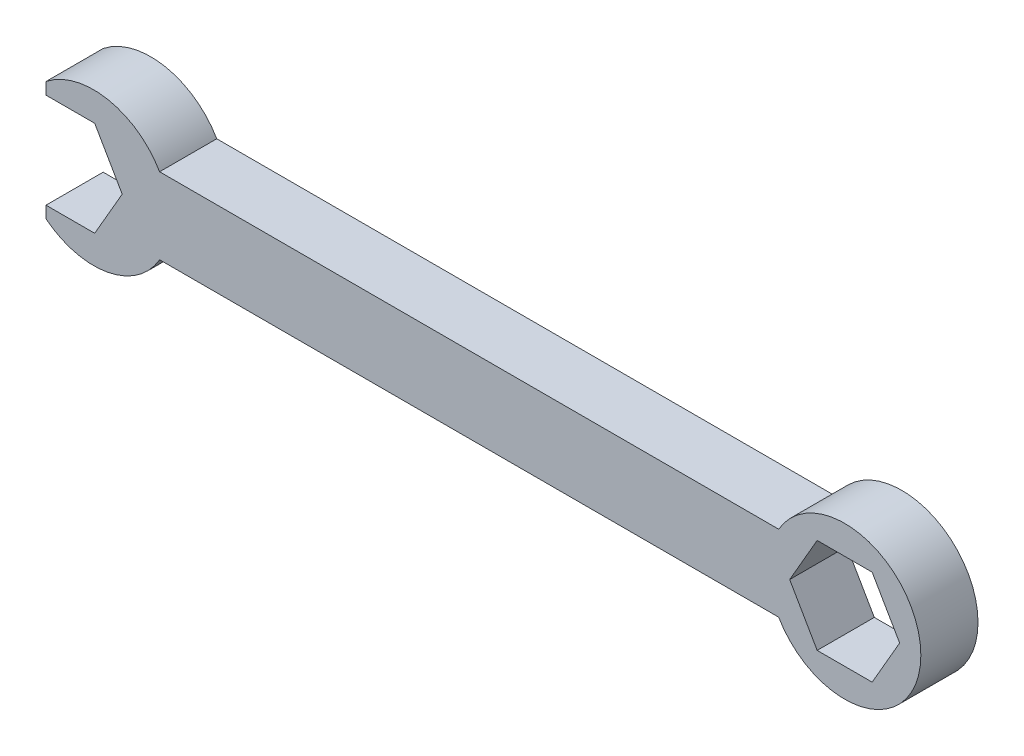
ISO-10303-21;
HEADER;
FILE_DESCRIPTION(('STEP AP214'),'2;1');
FILE_NAME('part.step','',(''),(''),'','','');
FILE_SCHEMA(('AUTOMOTIVE_DESIGN { 1 0 10303 214 1 1 1 1 }'));
ENDSEC;
DATA;
#1=APPLICATION_CONTEXT('core data for automotive mechanical design processes');
#2=APPLICATION_PROTOCOL_DEFINITION('international standard','automotive_design',2000,#1);
#3=PRODUCT_CONTEXT('',#1,'mechanical');
#4=PRODUCT('Part','Part','',(#3));
#5=PRODUCT_RELATED_PRODUCT_CATEGORY('part','',(#4));
#6=PRODUCT_DEFINITION_FORMATION('','',#4);
#7=PRODUCT_DEFINITION_CONTEXT('part definition',#1,'design');
#8=PRODUCT_DEFINITION('design','',#6,#7);
#9=PRODUCT_DEFINITION_SHAPE('','',#8);
#10=(LENGTH_UNIT() NAMED_UNIT(*) SI_UNIT(.MILLI.,.METRE.));
#11=(NAMED_UNIT(*) PLANE_ANGLE_UNIT() SI_UNIT($,.RADIAN.));
#12=(NAMED_UNIT(*) SI_UNIT($,.STERADIAN.) SOLID_ANGLE_UNIT());
#13=UNCERTAINTY_MEASURE_WITH_UNIT(LENGTH_MEASURE(1.E-05),#10,'distance_accuracy_value','');
#14=(GEOMETRIC_REPRESENTATION_CONTEXT(3) GLOBAL_UNCERTAINTY_ASSIGNED_CONTEXT((#13)) GLOBAL_UNIT_ASSIGNED_CONTEXT((#10,
#11,#12)) REPRESENTATION_CONTEXT('',''));
#15=CARTESIAN_POINT('',(0.,0.,0.));
#16=DIRECTION('',(0.,0.,1.));
#17=DIRECTION('',(1.,0.,0.));
#18=AXIS2_PLACEMENT_3D('',#15,#16,#17);
#19=CARTESIAN_POINT('',(5.49926131403122,-3.17499999999998,7.62));
#20=DIRECTION('',(-0.866025403784441,0.499999999999995,0.));
#21=DIRECTION('',(-0.499999999999995,-0.866025403784441,0.));
#22=AXIS2_PLACEMENT_3D('',#19,#20,#21);
#23=PLANE('',#22);
#24=DIRECTION('',(0.499999999999995,0.866025403784441,0.));
#25=VECTOR('',#24,1.);
#26=CARTESIAN_POINT('',(5.49926131403122,-3.17499999999998,0.));
#27=LINE('',#26,#25);
#28=CARTESIAN_POINT('',(3.6661742093542,-6.34999999999996,0.));
#29=VERTEX_POINT('',#28);
#30=CARTESIAN_POINT('',(7.33234841870825,0.,0.));
#31=VERTEX_POINT('',#30);
#32=EDGE_CURVE('E239',#29,#31,#27,.T.);
#33=ORIENTED_EDGE('',*,*,#32,.F.);
#34=DIRECTION('',(0.,0.,-1.));
#35=VECTOR('',#34,1.);
#36=CARTESIAN_POINT('',(3.6661742093542,-6.34999999999996,7.62));
#37=LINE('',#36,#35);
#38=CARTESIAN_POINT('',(3.6661742093542,-6.34999999999996,7.62));
#39=VERTEX_POINT('',#38);
#40=EDGE_CURVE('E11',#39,#29,#37,.T.);
#41=ORIENTED_EDGE('',*,*,#40,.F.);
#42=DIRECTION('',(0.499999999999995,0.866025403784441,0.));
#43=VECTOR('',#42,1.);
#44=CARTESIAN_POINT('',(5.49926131403122,-3.17499999999998,7.62));
#45=LINE('',#44,#43);
#46=CARTESIAN_POINT('',(7.33234841870825,0.,7.62));
#47=VERTEX_POINT('',#46);
#48=EDGE_CURVE('E357',#39,#47,#45,.T.);
#49=ORIENTED_EDGE('',*,*,#48,.T.);
#50=DIRECTION('',(0.,0.,-1.));
#51=VECTOR('',#50,1.);
#52=CARTESIAN_POINT('',(7.33234841870825,0.,7.62));
#53=LINE('',#52,#51);
#54=EDGE_CURVE('E61',#47,#31,#53,.T.);
#55=ORIENTED_EDGE('',*,*,#54,.T.);
#56=EDGE_LOOP('',(#33,#41,#49,#55));
#57=FACE_BOUND('',#56,.T.);
#58=ADVANCED_FACE('F41',(#57),#23,.T.);
#59=CARTESIAN_POINT('',(0.,-6.35,7.62));
#60=DIRECTION('',(0.,1.,0.));
#61=DIRECTION('',(-1.,0.,0.));
#62=AXIS2_PLACEMENT_3D('',#59,#60,#61);
#63=PLANE('',#62);
#64=DIRECTION('',(1.,0.,0.));
#65=VECTOR('',#64,1.);
#66=CARTESIAN_POINT('',(0.,-6.35,0.));
#67=LINE('',#66,#65);
#68=CARTESIAN_POINT('',(-3.66617420935407,-6.35000000000004,0.));
#69=VERTEX_POINT('',#68);
#70=EDGE_CURVE('E242',#69,#29,#67,.T.);
#71=ORIENTED_EDGE('',*,*,#70,.F.);
#72=DIRECTION('',(0.,0.,-1.));
#73=VECTOR('',#72,1.);
#74=CARTESIAN_POINT('',(-3.66617420935407,-6.35000000000004,7.62));
#75=LINE('',#74,#73);
#76=CARTESIAN_POINT('',(-3.66617420935407,-6.35000000000004,7.62));
#77=VERTEX_POINT('',#76);
#78=EDGE_CURVE('E52',#77,#69,#75,.T.);
#79=ORIENTED_EDGE('',*,*,#78,.F.);
#80=DIRECTION('',(1.,0.,0.));
#81=VECTOR('',#80,1.);
#82=CARTESIAN_POINT('',(0.,-6.35,7.62));
#83=LINE('',#82,#81);
#84=EDGE_CURVE('E360',#77,#39,#83,.T.);
#85=ORIENTED_EDGE('',*,*,#84,.T.);
#86=ORIENTED_EDGE('',*,*,#40,.T.);
#87=EDGE_LOOP('',(#71,#79,#85,#86));
#88=FACE_BOUND('',#87,.T.);
#89=ADVANCED_FACE('F383',(#88),#63,.T.);
#90=CARTESIAN_POINT('',(-5.49926131403116,-3.17500000000004,7.62));
#91=DIRECTION('',(0.866025403784435,0.500000000000007,0.));
#92=DIRECTION('',(-0.500000000000007,0.866025403784435,0.));
#93=AXIS2_PLACEMENT_3D('',#90,#91,#92);
#94=PLANE('',#93);
#95=DIRECTION('',(0.500000000000007,-0.866025403784435,0.));
#96=VECTOR('',#95,1.);
#97=CARTESIAN_POINT('',(-5.49926131403116,-3.17500000000004,0.));
#98=LINE('',#97,#96);
#99=CARTESIAN_POINT('',(-7.33234841870825,0.,0.));
#100=VERTEX_POINT('',#99);
#101=EDGE_CURVE('E246',#100,#69,#98,.T.);
#102=ORIENTED_EDGE('',*,*,#101,.F.);
#103=DIRECTION('',(0.,0.,-1.));
#104=VECTOR('',#103,1.);
#105=CARTESIAN_POINT('',(-7.33234841870825,0.,7.62));
#106=LINE('',#105,#104);
#107=CARTESIAN_POINT('',(-7.33234841870825,0.,7.62));
#108=VERTEX_POINT('',#107);
#109=EDGE_CURVE('E178',#108,#100,#106,.T.);
#110=ORIENTED_EDGE('',*,*,#109,.F.);
#111=DIRECTION('',(0.500000000000007,-0.866025403784435,0.));
#112=VECTOR('',#111,1.);
#113=CARTESIAN_POINT('',(-5.49926131403116,-3.17500000000004,7.62));
#114=LINE('',#113,#112);
#115=EDGE_CURVE('E189',#108,#77,#114,.T.);
#116=ORIENTED_EDGE('',*,*,#115,.T.);
#117=ORIENTED_EDGE('',*,*,#78,.T.);
#118=EDGE_LOOP('',(#102,#110,#116,#117));
#119=FACE_BOUND('',#118,.T.);
#120=ADVANCED_FACE('F366',(#119),#94,.T.);
#121=CARTESIAN_POINT('',(-5.4992613140312,3.17499999999997,7.62));
#122=DIRECTION('',(0.866025403784441,-0.499999999999995,0.));
#123=DIRECTION('',(0.499999999999995,0.866025403784442,0.));
#124=AXIS2_PLACEMENT_3D('',#121,#122,#123);
#125=PLANE('',#124);
#126=DIRECTION('',(-0.499999999999995,-0.866025403784442,0.));
#127=VECTOR('',#126,1.);
#128=CARTESIAN_POINT('',(-5.4992613140312,3.17499999999997,0.));
#129=LINE('',#128,#127);
#130=CARTESIAN_POINT('',(-3.66617420935415,6.34999999999999,0.));
#131=VERTEX_POINT('',#130);
#132=EDGE_CURVE('E173',#131,#100,#129,.T.);
#133=ORIENTED_EDGE('',*,*,#132,.F.);
#134=DIRECTION('',(0.,0.,-1.));
#135=VECTOR('',#134,1.);
#136=CARTESIAN_POINT('',(-3.66617420935415,6.34999999999999,7.62));
#137=LINE('',#136,#135);
#138=CARTESIAN_POINT('',(-3.66617420935415,6.34999999999999,7.62));
#139=VERTEX_POINT('',#138);
#140=EDGE_CURVE('E168',#139,#131,#137,.T.);
#141=ORIENTED_EDGE('',*,*,#140,.F.);
#142=DIRECTION('',(-0.499999999999995,-0.866025403784442,0.));
#143=VECTOR('',#142,1.);
#144=CARTESIAN_POINT('',(-5.4992613140312,3.17499999999997,7.62));
#145=LINE('',#144,#143);
#146=EDGE_CURVE('E171',#139,#108,#145,.T.);
#147=ORIENTED_EDGE('',*,*,#146,.T.);
#148=ORIENTED_EDGE('',*,*,#109,.T.);
#149=EDGE_LOOP('',(#133,#141,#147,#148));
#150=FACE_BOUND('',#149,.T.);
#151=ADVANCED_FACE('F170',(#150),#125,.T.);
#152=CARTESIAN_POINT('',(0.,6.35,7.62));
#153=DIRECTION('',(0.,-1.,0.));
#154=DIRECTION('',(1.,0.,0.));
#155=AXIS2_PLACEMENT_3D('',#152,#153,#154);
#156=PLANE('',#155);
#157=DIRECTION('',(-1.,0.,0.));
#158=VECTOR('',#157,1.);
#159=CARTESIAN_POINT('',(0.,6.35,0.));
#160=LINE('',#159,#158);
#161=CARTESIAN_POINT('',(3.66617420935411,6.35000000000001,0.));
#162=VERTEX_POINT('',#161);
#163=EDGE_CURVE('E252',#162,#131,#160,.T.);
#164=ORIENTED_EDGE('',*,*,#163,.F.);
#165=DIRECTION('',(0.,0.,-1.));
#166=VECTOR('',#165,1.);
#167=CARTESIAN_POINT('',(3.66617420935411,6.35000000000001,7.62));
#168=LINE('',#167,#166);
#169=CARTESIAN_POINT('',(3.66617420935411,6.35000000000001,7.62));
#170=VERTEX_POINT('',#169);
#171=EDGE_CURVE('E113',#170,#162,#168,.T.);
#172=ORIENTED_EDGE('',*,*,#171,.F.);
#173=DIRECTION('',(-1.,0.,0.));
#174=VECTOR('',#173,1.);
#175=CARTESIAN_POINT('',(0.,6.35,7.62));
#176=LINE('',#175,#174);
#177=EDGE_CURVE('E186',#170,#139,#176,.T.);
#178=ORIENTED_EDGE('',*,*,#177,.T.);
#179=ORIENTED_EDGE('',*,*,#140,.T.);
#180=EDGE_LOOP('',(#164,#172,#178,#179));
#181=FACE_BOUND('',#180,.T.);
#182=ADVANCED_FACE('F192',(#181),#156,.T.);
#183=CARTESIAN_POINT('',(-72.253227153675,-41.7154201469932,7.62));
#184=DIRECTION('',(-0.86602540378444,-0.499999999999998,0.));
#185=DIRECTION('',(0.499999999999998,-0.86602540378444,0.));
#186=AXIS2_PLACEMENT_3D('',#183,#184,#185);
#187=PLANE('',#186);
#188=DIRECTION('',(-0.499999999999998,0.86602540378444,0.));
#189=VECTOR('',#188,1.);
#190=CARTESIAN_POINT('',(-72.253227153675,-41.7154201469932,0.));
#191=LINE('',#190,#189);
#192=CARTESIAN_POINT('',(-96.3376362048998,0.,0.));
#193=VERTEX_POINT('',#192);
#194=CARTESIAN_POINT('',(-100.003810414254,6.35,0.));
#195=VERTEX_POINT('',#194);
#196=EDGE_CURVE('E201',#193,#195,#191,.T.);
#197=ORIENTED_EDGE('',*,*,#196,.F.);
#198=DIRECTION('',(0.,0.,-1.));
#199=VECTOR('',#198,1.);
#200=CARTESIAN_POINT('',(-96.3376362048998,0.,7.62));
#201=LINE('',#200,#199);
#202=CARTESIAN_POINT('',(-96.3376362048998,0.,7.62));
#203=VERTEX_POINT('',#202);
#204=EDGE_CURVE('E45',#203,#193,#201,.T.);
#205=ORIENTED_EDGE('',*,*,#204,.F.);
#206=DIRECTION('',(-0.499999999999998,0.86602540378444,0.));
#207=VECTOR('',#206,1.);
#208=CARTESIAN_POINT('',(-72.253227153675,-41.7154201469932,7.62));
#209=LINE('',#208,#207);
#210=CARTESIAN_POINT('',(-100.003810414254,6.35,7.62));
#211=VERTEX_POINT('',#210);
#212=EDGE_CURVE('E259',#203,#211,#209,.T.);
#213=ORIENTED_EDGE('',*,*,#212,.T.);
#214=DIRECTION('',(0.,0.,-1.));
#215=VECTOR('',#214,1.);
#216=CARTESIAN_POINT('',(-100.003810414254,6.35,7.62));
#217=LINE('',#216,#215);
#218=EDGE_CURVE('E197',#211,#195,#217,.T.);
#219=ORIENTED_EDGE('',*,*,#218,.T.);
#220=EDGE_LOOP('',(#197,#205,#213,#219));
#221=FACE_BOUND('',#220,.T.);
#222=ADVANCED_FACE('F43',(#221),#187,.T.);
#223=CARTESIAN_POINT('',(-72.2532271536749,41.7154201469933,7.62));
#224=DIRECTION('',(-0.866025403784439,0.499999999999999,0.));
#225=DIRECTION('',(-0.499999999999999,-0.866025403784439,0.));
#226=AXIS2_PLACEMENT_3D('',#223,#224,#225);
#227=PLANE('',#226);
#228=DIRECTION('',(0.499999999999999,0.866025403784439,0.));
#229=VECTOR('',#228,1.);
#230=CARTESIAN_POINT('',(-72.2532271536749,41.7154201469933,0.));
#231=LINE('',#230,#229);
#232=CARTESIAN_POINT('',(-100.003810414254,-6.35,0.));
#233=VERTEX_POINT('',#232);
#234=EDGE_CURVE('E205',#233,#193,#231,.T.);
#235=ORIENTED_EDGE('',*,*,#234,.F.);
#236=DIRECTION('',(0.,0.,-1.));
#237=VECTOR('',#236,1.);
#238=CARTESIAN_POINT('',(-100.003810414254,-6.35,7.62));
#239=LINE('',#238,#237);
#240=CARTESIAN_POINT('',(-100.003810414254,-6.35,7.62));
#241=VERTEX_POINT('',#240);
#242=EDGE_CURVE('E299',#241,#233,#239,.T.);
#243=ORIENTED_EDGE('',*,*,#242,.F.);
#244=DIRECTION('',(0.499999999999999,0.866025403784439,0.));
#245=VECTOR('',#244,1.);
#246=CARTESIAN_POINT('',(-72.2532271536749,41.7154201469933,7.62));
#247=LINE('',#246,#245);
#248=EDGE_CURVE('E310',#241,#203,#247,.T.);
#249=ORIENTED_EDGE('',*,*,#248,.T.);
#250=ORIENTED_EDGE('',*,*,#204,.T.);
#251=EDGE_LOOP('',(#235,#243,#249,#250));
#252=FACE_BOUND('',#251,.T.);
#253=ADVANCED_FACE('F308',(#252),#227,.T.);
#254=CARTESIAN_POINT('',(0.,-6.34999999999996,7.62));
#255=DIRECTION('',(0.,1.,0.));
#256=DIRECTION('',(-1.,0.,0.));
#257=AXIS2_PLACEMENT_3D('',#254,#255,#256);
#258=PLANE('',#257);
#259=DIRECTION('',(1.,0.,0.));
#260=VECTOR('',#259,1.);
#261=CARTESIAN_POINT('',(0.,-6.34999999999996,0.));
#262=LINE('',#261,#260);
#263=CARTESIAN_POINT('',(-106.4976362049,-6.35,0.));
#264=VERTEX_POINT('',#263);
#265=EDGE_CURVE('E209',#264,#233,#262,.T.);
#266=ORIENTED_EDGE('',*,*,#265,.F.);
#267=DIRECTION('',(0.,0.,-1.));
#268=VECTOR('',#267,1.);
#269=CARTESIAN_POINT('',(-106.4976362049,-6.35,7.62));
#270=LINE('',#269,#268);
#271=CARTESIAN_POINT('',(-106.4976362049,-6.35,7.62));
#272=VERTEX_POINT('',#271);
#273=EDGE_CURVE('E297',#272,#264,#270,.T.);
#274=ORIENTED_EDGE('',*,*,#273,.F.);
#275=DIRECTION('',(1.,0.,0.));
#276=VECTOR('',#275,1.);
#277=CARTESIAN_POINT('',(0.,-6.34999999999996,7.62));
#278=LINE('',#277,#276);
#279=EDGE_CURVE('E320',#272,#241,#278,.T.);
#280=ORIENTED_EDGE('',*,*,#279,.T.);
#281=ORIENTED_EDGE('',*,*,#242,.T.);
#282=EDGE_LOOP('',(#266,#274,#280,#281));
#283=FACE_BOUND('',#282,.T.);
#284=ADVANCED_FACE('F317',(#283),#258,.T.);
#285=CARTESIAN_POINT('',(-106.4976362049,0.,7.62));
#286=DIRECTION('',(1.,0.,0.));
#287=DIRECTION('',(0.,0.,-1.));
#288=AXIS2_PLACEMENT_3D('',#285,#286,#287);
#289=PLANE('',#288);
#290=DIRECTION('',(0.,-1.,0.));
#291=VECTOR('',#290,1.);
#292=CARTESIAN_POINT('',(-106.4976362049,0.,0.));
#293=LINE('',#292,#291);
#294=CARTESIAN_POINT('',(-106.4976362049,-7.93114745796599,0.));
#295=VERTEX_POINT('',#294);
#296=EDGE_CURVE('E213',#264,#295,#293,.T.);
#297=ORIENTED_EDGE('',*,*,#296,.T.);
#298=DIRECTION('',(0.,0.,-1.));
#299=VECTOR('',#298,1.);
#300=CARTESIAN_POINT('',(-106.4976362049,-7.93114745796599,7.62));
#301=LINE('',#300,#299);
#302=CARTESIAN_POINT('',(-106.4976362049,-7.93114745796599,7.62));
#303=VERTEX_POINT('',#302);
#304=EDGE_CURVE('E293',#303,#295,#301,.T.);
#305=ORIENTED_EDGE('',*,*,#304,.F.);
#306=DIRECTION('',(0.,-1.,0.));
#307=VECTOR('',#306,1.);
#308=CARTESIAN_POINT('',(-106.4976362049,0.,7.62));
#309=LINE('',#308,#307);
#310=EDGE_CURVE('E323',#272,#303,#309,.T.);
#311=ORIENTED_EDGE('',*,*,#310,.F.);
#312=ORIENTED_EDGE('',*,*,#273,.T.);
#313=EDGE_LOOP('',(#297,#305,#311,#312));
#314=FACE_BOUND('',#313,.T.);
#315=ADVANCED_FACE('F324',(#314),#289,.F.);
#316=CARTESIAN_POINT('',(-100.1476362049,0.,7.62));
#317=DIRECTION('',(0.,0.,-1.));
#318=DIRECTION('',(-1.,0.,0.));
#319=AXIS2_PLACEMENT_3D('',#316,#317,#318);
#320=CYLINDRICAL_SURFACE('',#319,10.16);
#321=CARTESIAN_POINT('',(-100.1476362049,0.,0.));
#322=DIRECTION('',(0.,0.,1.));
#323=DIRECTION('',(1.,0.,0.));
#324=AXIS2_PLACEMENT_3D('',#321,#322,#323);
#325=CIRCLE('',#324,10.16);
#326=CARTESIAN_POINT('',(-91.3488181024499,-5.08000000000003,0.));
#327=VERTEX_POINT('',#326);
#328=EDGE_CURVE('E216',#295,#327,#325,.T.);
#329=ORIENTED_EDGE('',*,*,#328,.T.);
#330=DIRECTION('',(0.,0.,-1.));
#331=VECTOR('',#330,1.);
#332=CARTESIAN_POINT('',(-91.3488181024499,-5.08000000000003,7.62));
#333=LINE('',#332,#331);
#334=CARTESIAN_POINT('',(-91.3488181024499,-5.08000000000003,7.62));
#335=VERTEX_POINT('',#334);
#336=EDGE_CURVE('E289',#335,#327,#333,.T.);
#337=ORIENTED_EDGE('',*,*,#336,.F.);
#338=CARTESIAN_POINT('',(-100.1476362049,0.,7.62));
#339=DIRECTION('',(0.,0.,1.));
#340=DIRECTION('',(1.,0.,0.));
#341=AXIS2_PLACEMENT_3D('',#338,#339,#340);
#342=CIRCLE('',#341,10.16);
#343=EDGE_CURVE('E328',#303,#335,#342,.T.);
#344=ORIENTED_EDGE('',*,*,#343,.F.);
#345=ORIENTED_EDGE('',*,*,#304,.T.);
#346=EDGE_LOOP('',(#329,#337,#344,#345));
#347=FACE_BOUND('',#346,.T.);
#348=ADVANCED_FACE('F410',(#347),#320,.T.);
#349=CARTESIAN_POINT('',(0.,-5.08000000000003,7.62));
#350=DIRECTION('',(0.,1.,0.));
#351=DIRECTION('',(0.,0.,1.));
#352=AXIS2_PLACEMENT_3D('',#349,#350,#351);
#353=PLANE('',#352);
#354=DIRECTION('',(1.,0.,0.));
#355=VECTOR('',#354,1.);
#356=CARTESIAN_POINT('',(0.,-5.08000000000003,0.));
#357=LINE('',#356,#355);
#358=CARTESIAN_POINT('',(-8.79881810244988,-5.08000000000003,0.));
#359=VERTEX_POINT('',#358);
#360=EDGE_CURVE('E219',#327,#359,#357,.T.);
#361=ORIENTED_EDGE('',*,*,#360,.T.);
#362=DIRECTION('',(0.,0.,-1.));
#363=VECTOR('',#362,1.);
#364=CARTESIAN_POINT('',(-8.79881810244988,-5.08000000000003,7.62));
#365=LINE('',#364,#363);
#366=CARTESIAN_POINT('',(-8.79881810244988,-5.08000000000003,7.62));
#367=VERTEX_POINT('',#366);
#368=EDGE_CURVE('E285',#367,#359,#365,.T.);
#369=ORIENTED_EDGE('',*,*,#368,.F.);
#370=DIRECTION('',(1.,0.,0.));
#371=VECTOR('',#370,1.);
#372=CARTESIAN_POINT('',(0.,-5.08000000000003,7.62));
#373=LINE('',#372,#371);
#374=EDGE_CURVE('E338',#335,#367,#373,.T.);
#375=ORIENTED_EDGE('',*,*,#374,.F.);
#376=ORIENTED_EDGE('',*,*,#336,.T.);
#377=EDGE_LOOP('',(#361,#369,#375,#376));
#378=FACE_BOUND('',#377,.T.);
#379=ADVANCED_FACE('F406',(#378),#353,.F.);
#380=CARTESIAN_POINT('',(0.,0.,7.62));
#381=DIRECTION('',(0.,0.,-1.));
#382=DIRECTION('',(-1.,0.,0.));
#383=AXIS2_PLACEMENT_3D('',#380,#381,#382);
#384=CYLINDRICAL_SURFACE('',#383,10.16);
#385=CARTESIAN_POINT('',(0.,0.,0.));
#386=DIRECTION('',(0.,0.,1.));
#387=DIRECTION('',(1.,0.,0.));
#388=AXIS2_PLACEMENT_3D('',#385,#386,#387);
#389=CIRCLE('',#388,10.16);
#390=CARTESIAN_POINT('',(-8.7988181024499,5.08,0.));
#391=VERTEX_POINT('',#390);
#392=EDGE_CURVE('E222',#359,#391,#389,.T.);
#393=ORIENTED_EDGE('',*,*,#392,.T.);
#394=DIRECTION('',(0.,0.,-1.));
#395=VECTOR('',#394,1.);
#396=CARTESIAN_POINT('',(-8.7988181024499,5.08,7.62));
#397=LINE('',#396,#395);
#398=CARTESIAN_POINT('',(-8.7988181024499,5.08,7.62));
#399=VERTEX_POINT('',#398);
#400=EDGE_CURVE('E281',#399,#391,#397,.T.);
#401=ORIENTED_EDGE('',*,*,#400,.F.);
#402=CARTESIAN_POINT('',(0.,0.,7.62));
#403=DIRECTION('',(0.,0.,1.));
#404=DIRECTION('',(1.,0.,0.));
#405=AXIS2_PLACEMENT_3D('',#402,#403,#404);
#406=CIRCLE('',#405,10.16);
#407=EDGE_CURVE('E341',#367,#399,#406,.T.);
#408=ORIENTED_EDGE('',*,*,#407,.F.);
#409=ORIENTED_EDGE('',*,*,#368,.T.);
#410=EDGE_LOOP('',(#393,#401,#408,#409));
#411=FACE_BOUND('',#410,.T.);
#412=ADVANCED_FACE('F402',(#411),#384,.T.);
#413=CARTESIAN_POINT('',(0.,5.08,7.62));
#414=DIRECTION('',(0.,-1.,0.));
#415=DIRECTION('',(1.,0.,0.));
#416=AXIS2_PLACEMENT_3D('',#413,#414,#415);
#417=PLANE('',#416);
#418=DIRECTION('',(-1.,0.,0.));
#419=VECTOR('',#418,1.);
#420=CARTESIAN_POINT('',(0.,5.08,0.));
#421=LINE('',#420,#419);
#422=CARTESIAN_POINT('',(-91.3488181024499,5.07999999999999,0.));
#423=VERTEX_POINT('',#422);
#424=EDGE_CURVE('E225',#391,#423,#421,.T.);
#425=ORIENTED_EDGE('',*,*,#424,.T.);
#426=DIRECTION('',(0.,0.,-1.));
#427=VECTOR('',#426,1.);
#428=CARTESIAN_POINT('',(-91.3488181024499,5.07999999999999,7.62));
#429=LINE('',#428,#427);
#430=CARTESIAN_POINT('',(-91.3488181024499,5.07999999999999,7.62));
#431=VERTEX_POINT('',#430);
#432=EDGE_CURVE('E277',#431,#423,#429,.T.);
#433=ORIENTED_EDGE('',*,*,#432,.F.);
#434=DIRECTION('',(-1.,0.,0.));
#435=VECTOR('',#434,1.);
#436=CARTESIAN_POINT('',(0.,5.08,7.62));
#437=LINE('',#436,#435);
#438=EDGE_CURVE('E344',#399,#431,#437,.T.);
#439=ORIENTED_EDGE('',*,*,#438,.F.);
#440=ORIENTED_EDGE('',*,*,#400,.T.);
#441=EDGE_LOOP('',(#425,#433,#439,#440));
#442=FACE_BOUND('',#441,.T.);
#443=ADVANCED_FACE('F398',(#442),#417,.F.);
#444=CARTESIAN_POINT('',(-100.1476362049,0.,7.62));
#445=DIRECTION('',(0.,0.,-1.));
#446=DIRECTION('',(-1.,0.,0.));
#447=AXIS2_PLACEMENT_3D('',#444,#445,#446);
#448=CYLINDRICAL_SURFACE('',#447,10.16);
#449=CARTESIAN_POINT('',(-100.1476362049,0.,0.));
#450=DIRECTION('',(0.,0.,1.));
#451=DIRECTION('',(1.,0.,0.));
#452=AXIS2_PLACEMENT_3D('',#449,#450,#451);
#453=CIRCLE('',#452,10.16);
#454=CARTESIAN_POINT('',(-106.4976362049,7.93114745796597,0.));
#455=VERTEX_POINT('',#454);
#456=EDGE_CURVE('E228',#423,#455,#453,.T.);
#457=ORIENTED_EDGE('',*,*,#456,.T.);
#458=DIRECTION('',(0.,0.,-1.));
#459=VECTOR('',#458,1.);
#460=CARTESIAN_POINT('',(-106.4976362049,7.93114745796597,7.62));
#461=LINE('',#460,#459);
#462=CARTESIAN_POINT('',(-106.4976362049,7.93114745796597,7.62));
#463=VERTEX_POINT('',#462);
#464=EDGE_CURVE('E273',#463,#455,#461,.T.);
#465=ORIENTED_EDGE('',*,*,#464,.F.);
#466=CARTESIAN_POINT('',(-100.1476362049,0.,7.62));
#467=DIRECTION('',(0.,0.,1.));
#468=DIRECTION('',(1.,0.,0.));
#469=AXIS2_PLACEMENT_3D('',#466,#467,#468);
#470=CIRCLE('',#469,10.16);
#471=EDGE_CURVE('E347',#431,#463,#470,.T.);
#472=ORIENTED_EDGE('',*,*,#471,.F.);
#473=ORIENTED_EDGE('',*,*,#432,.T.);
#474=EDGE_LOOP('',(#457,#465,#472,#473));
#475=FACE_BOUND('',#474,.T.);
#476=ADVANCED_FACE('F394',(#475),#448,.T.);
#477=CARTESIAN_POINT('',(-106.4976362049,0.,7.62));
#478=DIRECTION('',(1.,0.,0.));
#479=DIRECTION('',(0.,0.,-1.));
#480=AXIS2_PLACEMENT_3D('',#477,#478,#479);
#481=PLANE('',#480);
#482=DIRECTION('',(0.,-1.,0.));
#483=VECTOR('',#482,1.);
#484=CARTESIAN_POINT('',(-106.4976362049,0.,0.));
#485=LINE('',#484,#483);
#486=CARTESIAN_POINT('',(-106.4976362049,6.35,0.));
#487=VERTEX_POINT('',#486);
#488=EDGE_CURVE('E231',#455,#487,#485,.T.);
#489=ORIENTED_EDGE('',*,*,#488,.T.);
#490=DIRECTION('',(0.,0.,-1.));
#491=VECTOR('',#490,1.);
#492=CARTESIAN_POINT('',(-106.4976362049,6.35,7.62));
#493=LINE('',#492,#491);
#494=CARTESIAN_POINT('',(-106.4976362049,6.35,7.62));
#495=VERTEX_POINT('',#494);
#496=EDGE_CURVE('E270',#495,#487,#493,.T.);
#497=ORIENTED_EDGE('',*,*,#496,.F.);
#498=DIRECTION('',(0.,-1.,0.));
#499=VECTOR('',#498,1.);
#500=CARTESIAN_POINT('',(-106.4976362049,0.,7.62));
#501=LINE('',#500,#499);
#502=EDGE_CURVE('E350',#463,#495,#501,.T.);
#503=ORIENTED_EDGE('',*,*,#502,.F.);
#504=ORIENTED_EDGE('',*,*,#464,.T.);
#505=EDGE_LOOP('',(#489,#497,#503,#504));
#506=FACE_BOUND('',#505,.T.);
#507=ADVANCED_FACE('F377',(#506),#481,.F.);
#508=CARTESIAN_POINT('',(0.,6.35000000000001,7.62));
#509=DIRECTION('',(0.,-1.,0.));
#510=DIRECTION('',(1.,0.,0.));
#511=AXIS2_PLACEMENT_3D('',#508,#509,#510);
#512=PLANE('',#511);
#513=DIRECTION('',(-1.,0.,0.));
#514=VECTOR('',#513,1.);
#515=CARTESIAN_POINT('',(0.,6.35000000000001,0.));
#516=LINE('',#515,#514);
#517=EDGE_CURVE('E235',#195,#487,#516,.T.);
#518=ORIENTED_EDGE('',*,*,#517,.F.);
#519=ORIENTED_EDGE('',*,*,#218,.F.);
#520=DIRECTION('',(-1.,0.,0.));
#521=VECTOR('',#520,1.);
#522=CARTESIAN_POINT('',(0.,6.35000000000001,7.62));
#523=LINE('',#522,#521);
#524=EDGE_CURVE('E353',#211,#495,#523,.T.);
#525=ORIENTED_EDGE('',*,*,#524,.T.);
#526=ORIENTED_EDGE('',*,*,#496,.T.);
#527=EDGE_LOOP('',(#518,#519,#525,#526));
#528=FACE_BOUND('',#527,.T.);
#529=ADVANCED_FACE('F370',(#528),#512,.T.);
#530=CARTESIAN_POINT('',(5.49926131403118,3.17500000000001,7.62));
#531=DIRECTION('',(-0.866025403784438,-0.500000000000001,0.));
#532=DIRECTION('',(0.500000000000001,-0.866025403784438,0.));
#533=AXIS2_PLACEMENT_3D('',#530,#531,#532);
#534=PLANE('',#533);
#535=DIRECTION('',(-0.500000000000001,0.866025403784438,0.));
#536=VECTOR('',#535,1.);
#537=CARTESIAN_POINT('',(5.49926131403118,3.17500000000001,0.));
#538=LINE('',#537,#536);
#539=EDGE_CURVE('E255',#31,#162,#538,.T.);
#540=ORIENTED_EDGE('',*,*,#539,.F.);
#541=ORIENTED_EDGE('',*,*,#54,.F.);
#542=DIRECTION('',(-0.500000000000001,0.866025403784438,0.));
#543=VECTOR('',#542,1.);
#544=CARTESIAN_POINT('',(5.49926131403118,3.17500000000001,7.62));
#545=LINE('',#544,#543);
#546=EDGE_CURVE('E194',#47,#170,#545,.T.);
#547=ORIENTED_EDGE('',*,*,#546,.T.);
#548=ORIENTED_EDGE('',*,*,#171,.T.);
#549=EDGE_LOOP('',(#540,#541,#547,#548));
#550=FACE_BOUND('',#549,.T.);
#551=ADVANCED_FACE('F368',(#550),#534,.T.);
#552=CARTESIAN_POINT('',(0.,0.,7.62));
#553=DIRECTION('',(0.,0.,1.));
#554=DIRECTION('',(1.,0.,0.));
#555=AXIS2_PLACEMENT_3D('',#552,#553,#554);
#556=PLANE('',#555);
#557=ORIENTED_EDGE('',*,*,#212,.F.);
#558=ORIENTED_EDGE('',*,*,#248,.F.);
#559=ORIENTED_EDGE('',*,*,#279,.F.);
#560=ORIENTED_EDGE('',*,*,#310,.T.);
#561=ORIENTED_EDGE('',*,*,#343,.T.);
#562=ORIENTED_EDGE('',*,*,#374,.T.);
#563=ORIENTED_EDGE('',*,*,#407,.T.);
#564=ORIENTED_EDGE('',*,*,#438,.T.);
#565=ORIENTED_EDGE('',*,*,#471,.T.);
#566=ORIENTED_EDGE('',*,*,#502,.T.);
#567=ORIENTED_EDGE('',*,*,#524,.F.);
#568=EDGE_LOOP('',(#557,#558,#559,#560,#561,#562,#563,#564,#565,#566,#567));
#569=FACE_BOUND('',#568,.T.);
#570=ORIENTED_EDGE('',*,*,#48,.F.);
#571=ORIENTED_EDGE('',*,*,#84,.F.);
#572=ORIENTED_EDGE('',*,*,#115,.F.);
#573=ORIENTED_EDGE('',*,*,#146,.F.);
#574=ORIENTED_EDGE('',*,*,#177,.F.);
#575=ORIENTED_EDGE('',*,*,#546,.F.);
#576=EDGE_LOOP('',(#570,#571,#572,#573,#574,#575));
#577=FACE_BOUND('',#576,.T.);
#578=ADVANCED_FACE('F184',(#569,#577),#556,.T.);
#579=CARTESIAN_POINT('',(0.,0.,0.));
#580=DIRECTION('',(0.,0.,1.));
#581=DIRECTION('',(1.,0.,0.));
#582=AXIS2_PLACEMENT_3D('',#579,#580,#581);
#583=PLANE('',#582);
#584=ORIENTED_EDGE('',*,*,#196,.T.);
#585=ORIENTED_EDGE('',*,*,#517,.T.);
#586=ORIENTED_EDGE('',*,*,#488,.F.);
#587=ORIENTED_EDGE('',*,*,#456,.F.);
#588=ORIENTED_EDGE('',*,*,#424,.F.);
#589=ORIENTED_EDGE('',*,*,#392,.F.);
#590=ORIENTED_EDGE('',*,*,#360,.F.);
#591=ORIENTED_EDGE('',*,*,#328,.F.);
#592=ORIENTED_EDGE('',*,*,#296,.F.);
#593=ORIENTED_EDGE('',*,*,#265,.T.);
#594=ORIENTED_EDGE('',*,*,#234,.T.);
#595=EDGE_LOOP('',(#584,#585,#586,#587,#588,#589,#590,#591,#592,#593,#594));
#596=FACE_BOUND('',#595,.T.);
#597=ORIENTED_EDGE('',*,*,#32,.T.);
#598=ORIENTED_EDGE('',*,*,#539,.T.);
#599=ORIENTED_EDGE('',*,*,#163,.T.);
#600=ORIENTED_EDGE('',*,*,#132,.T.);
#601=ORIENTED_EDGE('',*,*,#101,.T.);
#602=ORIENTED_EDGE('',*,*,#70,.T.);
#603=EDGE_LOOP('',(#597,#598,#599,#600,#601,#602));
#604=FACE_BOUND('',#603,.T.);
#605=ADVANCED_FACE('F313',(#596,#604),#583,.F.);
#606=CLOSED_SHELL('',(#58,#89,#120,#151,#182,#222,#253,#284,#315,#348,#379,#412,#443,#476,#507,
#529,#551,#578,#605));
#607=MANIFOLD_SOLID_BREP('B2',#606);
#608=ADVANCED_BREP_SHAPE_REPRESENTATION('',(#18,#607),#14);
#609=SHAPE_DEFINITION_REPRESENTATION(#9,#608);
ENDSEC;
END-ISO-10303-21;
